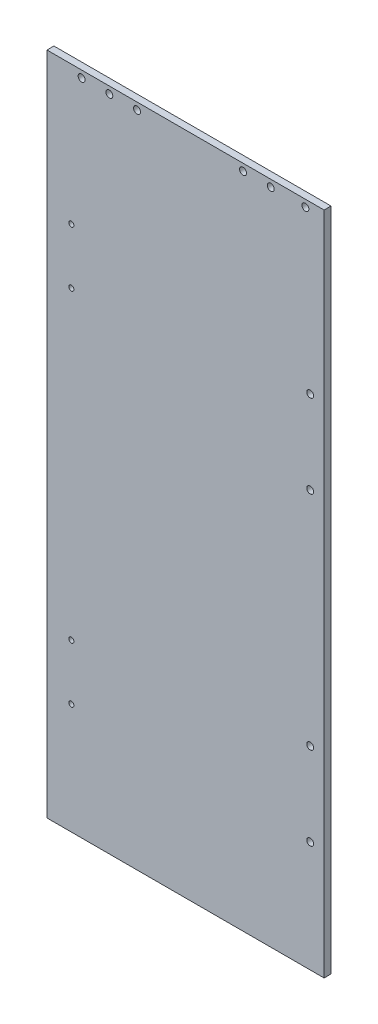
ISO-10303-21;
HEADER;
FILE_DESCRIPTION(('STEP AP214'),'2;1');
FILE_NAME('part.step','',(''),(''),'','','');
FILE_SCHEMA(('AUTOMOTIVE_DESIGN { 1 0 10303 214 1 1 1 1 }'));
ENDSEC;
DATA;
#1=APPLICATION_CONTEXT('core data for automotive mechanical design processes');
#2=APPLICATION_PROTOCOL_DEFINITION('international standard','automotive_design',2000,#1);
#3=PRODUCT_CONTEXT('',#1,'mechanical');
#4=PRODUCT('Part','Part','',(#3));
#5=PRODUCT_RELATED_PRODUCT_CATEGORY('part','',(#4));
#6=PRODUCT_DEFINITION_FORMATION('','',#4);
#7=PRODUCT_DEFINITION_CONTEXT('part definition',#1,'design');
#8=PRODUCT_DEFINITION('design','',#6,#7);
#9=PRODUCT_DEFINITION_SHAPE('','',#8);
#10=(LENGTH_UNIT() NAMED_UNIT(*) SI_UNIT(.MILLI.,.METRE.));
#11=(NAMED_UNIT(*) PLANE_ANGLE_UNIT() SI_UNIT($,.RADIAN.));
#12=(NAMED_UNIT(*) SI_UNIT($,.STERADIAN.) SOLID_ANGLE_UNIT());
#13=UNCERTAINTY_MEASURE_WITH_UNIT(LENGTH_MEASURE(1.E-05),#10,'distance_accuracy_value','');
#14=(GEOMETRIC_REPRESENTATION_CONTEXT(3) GLOBAL_UNCERTAINTY_ASSIGNED_CONTEXT((#13)) GLOBAL_UNIT_ASSIGNED_CONTEXT((#10,
#11,#12)) REPRESENTATION_CONTEXT('',''));
#15=CARTESIAN_POINT('',(0.,0.,0.));
#16=DIRECTION('',(0.,0.,1.));
#17=DIRECTION('',(1.,0.,0.));
#18=AXIS2_PLACEMENT_3D('',#15,#16,#17);
#19=CARTESIAN_POINT('',(-28.5749999999999,0.,6.35));
#20=DIRECTION('',(1.,0.,0.));
#21=DIRECTION('',(0.,1.,0.));
#22=AXIS2_PLACEMENT_3D('',#19,#20,#21);
#23=PLANE('',#22);
#24=DIRECTION('',(0.,-1.,0.));
#25=VECTOR('',#24,1.);
#26=CARTESIAN_POINT('',(-28.5749999999999,0.,0.));
#27=LINE('',#26,#25);
#28=CARTESIAN_POINT('',(-28.5749999999999,0.,0.));
#29=VERTEX_POINT('',#28);
#30=CARTESIAN_POINT('',(-28.5749999999999,-609.6,0.));
#31=VERTEX_POINT('',#30);
#32=EDGE_CURVE('E102',#29,#31,#27,.T.);
#33=ORIENTED_EDGE('',*,*,#32,.T.);
#34=DIRECTION('',(0.,0.,-1.));
#35=VECTOR('',#34,1.);
#36=CARTESIAN_POINT('',(-28.5749999999999,-609.6,6.35));
#37=LINE('',#36,#35);
#38=CARTESIAN_POINT('',(-28.5749999999999,-609.6,6.35));
#39=VERTEX_POINT('',#38);
#40=EDGE_CURVE('E11',#39,#31,#37,.T.);
#41=ORIENTED_EDGE('',*,*,#40,.F.);
#42=DIRECTION('',(0.,-1.,0.));
#43=VECTOR('',#42,1.);
#44=CARTESIAN_POINT('',(-28.5749999999999,0.,6.35));
#45=LINE('',#44,#43);
#46=CARTESIAN_POINT('',(-28.5749999999999,0.,6.35));
#47=VERTEX_POINT('',#46);
#48=EDGE_CURVE('E90',#47,#39,#45,.T.);
#49=ORIENTED_EDGE('',*,*,#48,.F.);
#50=DIRECTION('',(0.,0.,-1.));
#51=VECTOR('',#50,1.);
#52=CARTESIAN_POINT('',(-28.5749999999999,0.,6.35));
#53=LINE('',#52,#51);
#54=EDGE_CURVE('E98',#47,#29,#53,.T.);
#55=ORIENTED_EDGE('',*,*,#54,.T.);
#56=EDGE_LOOP('',(#33,#41,#49,#55));
#57=FACE_BOUND('',#56,.T.);
#58=ADVANCED_FACE('F39',(#57),#23,.F.);
#59=CARTESIAN_POINT('',(-28.5749999999999,-609.6,6.35));
#60=DIRECTION('',(0.,1.,0.));
#61=DIRECTION('',(0.,0.,1.));
#62=AXIS2_PLACEMENT_3D('',#59,#60,#61);
#63=PLANE('',#62);
#64=DIRECTION('',(1.,0.,0.));
#65=VECTOR('',#64,1.);
#66=CARTESIAN_POINT('',(-28.5749999999999,-609.6,0.));
#67=LINE('',#66,#65);
#68=CARTESIAN_POINT('',(225.425,-609.6,0.));
#69=VERTEX_POINT('',#68);
#70=EDGE_CURVE('E94',#31,#69,#67,.T.);
#71=ORIENTED_EDGE('',*,*,#70,.T.);
#72=DIRECTION('',(0.,0.,-1.));
#73=VECTOR('',#72,1.);
#74=CARTESIAN_POINT('',(225.425,-609.6,6.35));
#75=LINE('',#74,#73);
#76=CARTESIAN_POINT('',(225.425,-609.6,6.35));
#77=VERTEX_POINT('',#76);
#78=EDGE_CURVE('E47',#77,#69,#75,.T.);
#79=ORIENTED_EDGE('',*,*,#78,.F.);
#80=DIRECTION('',(1.,0.,0.));
#81=VECTOR('',#80,1.);
#82=CARTESIAN_POINT('',(-28.5749999999999,-609.6,6.35));
#83=LINE('',#82,#81);
#84=EDGE_CURVE('E85',#39,#77,#83,.T.);
#85=ORIENTED_EDGE('',*,*,#84,.F.);
#86=ORIENTED_EDGE('',*,*,#40,.T.);
#87=EDGE_LOOP('',(#71,#79,#85,#86));
#88=FACE_BOUND('',#87,.T.);
#89=ADVANCED_FACE('F93',(#88),#63,.F.);
#90=CARTESIAN_POINT('',(225.425,0.,6.35));
#91=DIRECTION('',(-1.,0.,0.));
#92=DIRECTION('',(0.,-1.,0.));
#93=AXIS2_PLACEMENT_3D('',#90,#91,#92);
#94=PLANE('',#93);
#95=DIRECTION('',(0.,1.,0.));
#96=VECTOR('',#95,1.);
#97=CARTESIAN_POINT('',(225.425,0.,0.));
#98=LINE('',#97,#96);
#99=CARTESIAN_POINT('',(225.425,0.,0.));
#100=VERTEX_POINT('',#99);
#101=EDGE_CURVE('E72',#69,#100,#98,.T.);
#102=ORIENTED_EDGE('',*,*,#101,.T.);
#103=DIRECTION('',(0.,0.,-1.));
#104=VECTOR('',#103,1.);
#105=CARTESIAN_POINT('',(225.425,0.,6.35));
#106=LINE('',#105,#104);
#107=CARTESIAN_POINT('',(225.425,0.,6.35));
#108=VERTEX_POINT('',#107);
#109=EDGE_CURVE('E95',#108,#100,#106,.T.);
#110=ORIENTED_EDGE('',*,*,#109,.F.);
#111=DIRECTION('',(0.,1.,0.));
#112=VECTOR('',#111,1.);
#113=CARTESIAN_POINT('',(225.425,0.,6.35));
#114=LINE('',#113,#112);
#115=EDGE_CURVE('E88',#77,#108,#114,.T.);
#116=ORIENTED_EDGE('',*,*,#115,.F.);
#117=ORIENTED_EDGE('',*,*,#78,.T.);
#118=EDGE_LOOP('',(#102,#110,#116,#117));
#119=FACE_BOUND('',#118,.T.);
#120=ADVANCED_FACE('F96',(#119),#94,.F.);
#121=CARTESIAN_POINT('',(-28.5749999999999,0.,6.35));
#122=DIRECTION('',(0.,-1.,0.));
#123=DIRECTION('',(0.,0.,-1.));
#124=AXIS2_PLACEMENT_3D('',#121,#122,#123);
#125=PLANE('',#124);
#126=DIRECTION('',(-1.,0.,0.));
#127=VECTOR('',#126,1.);
#128=CARTESIAN_POINT('',(-28.5749999999999,0.,0.));
#129=LINE('',#128,#127);
#130=EDGE_CURVE('E78',#100,#29,#129,.T.);
#131=ORIENTED_EDGE('',*,*,#130,.T.);
#132=ORIENTED_EDGE('',*,*,#54,.F.);
#133=DIRECTION('',(-1.,0.,0.));
#134=VECTOR('',#133,1.);
#135=CARTESIAN_POINT('',(-28.5749999999999,0.,6.35));
#136=LINE('',#135,#134);
#137=EDGE_CURVE('E55',#108,#47,#136,.T.);
#138=ORIENTED_EDGE('',*,*,#137,.F.);
#139=ORIENTED_EDGE('',*,*,#109,.T.);
#140=EDGE_LOOP('',(#131,#132,#138,#139));
#141=FACE_BOUND('',#140,.T.);
#142=ADVANCED_FACE('F110',(#141),#125,.F.);
#143=CARTESIAN_POINT('',(0.,0.,6.35));
#144=DIRECTION('',(0.,0.,1.));
#145=DIRECTION('',(1.,0.,0.));
#146=AXIS2_PLACEMENT_3D('',#143,#144,#145);
#147=PLANE('',#146);
#148=CARTESIAN_POINT('',(212.706676403292,-152.4,6.35));
#149=DIRECTION('',(0.,0.,1.));
#150=DIRECTION('',(1.,0.,0.));
#151=AXIS2_PLACEMENT_3D('',#148,#149,#150);
#152=CIRCLE('',#151,3.175);
#153=CARTESIAN_POINT('',(215.881676403292,-152.4,6.35));
#154=VERTEX_POINT('',#153);
#155=EDGE_CURVE('E182',#154,#154,#152,.T.);
#156=ORIENTED_EDGE('',*,*,#155,.F.);
#157=EDGE_LOOP('',(#156));
#158=FACE_BOUND('',#157,.T.);
#159=CARTESIAN_POINT('',(212.706676403292,-228.6,6.35));
#160=DIRECTION('',(0.,0.,1.));
#161=DIRECTION('',(1.,0.,0.));
#162=AXIS2_PLACEMENT_3D('',#159,#160,#161);
#163=CIRCLE('',#162,3.175);
#164=CARTESIAN_POINT('',(215.881676403292,-228.6,6.35));
#165=VERTEX_POINT('',#164);
#166=EDGE_CURVE('E188',#165,#165,#163,.T.);
#167=ORIENTED_EDGE('',*,*,#166,.F.);
#168=EDGE_LOOP('',(#167));
#169=FACE_BOUND('',#168,.T.);
#170=CARTESIAN_POINT('',(212.706676403292,-508.,6.35));
#171=DIRECTION('',(0.,0.,1.));
#172=DIRECTION('',(1.,0.,0.));
#173=AXIS2_PLACEMENT_3D('',#170,#171,#172);
#174=CIRCLE('',#173,3.175);
#175=CARTESIAN_POINT('',(215.881676403292,-508.,6.35));
#176=VERTEX_POINT('',#175);
#177=EDGE_CURVE('E194',#176,#176,#174,.T.);
#178=ORIENTED_EDGE('',*,*,#177,.F.);
#179=EDGE_LOOP('',(#178));
#180=FACE_BOUND('',#179,.T.);
#181=CARTESIAN_POINT('',(212.706676403292,-431.8,6.35));
#182=DIRECTION('',(0.,0.,1.));
#183=DIRECTION('',(1.,0.,0.));
#184=AXIS2_PLACEMENT_3D('',#181,#182,#183);
#185=CIRCLE('',#184,3.175);
#186=CARTESIAN_POINT('',(215.881676403292,-431.8,6.35));
#187=VERTEX_POINT('',#186);
#188=EDGE_CURVE('E176',#187,#187,#185,.T.);
#189=ORIENTED_EDGE('',*,*,#188,.F.);
#190=EDGE_LOOP('',(#189));
#191=FACE_BOUND('',#190,.T.);
#192=CARTESIAN_POINT('',(208.28,-6.35000000001205,6.35));
#193=DIRECTION('',(0.,0.,-1.));
#194=DIRECTION('',(-1.,0.,0.));
#195=AXIS2_PLACEMENT_3D('',#192,#193,#194);
#196=CIRCLE('',#195,3.175);
#197=CARTESIAN_POINT('',(205.105,-6.35000000001205,6.35));
#198=VERTEX_POINT('',#197);
#199=EDGE_CURVE('E120',#198,#198,#196,.T.);
#200=ORIENTED_EDGE('',*,*,#199,.T.);
#201=EDGE_LOOP('',(#200));
#202=FACE_BOUND('',#201,.T.);
#203=CARTESIAN_POINT('',(176.53,-6.35000000001205,6.35));
#204=DIRECTION('',(0.,0.,-1.));
#205=DIRECTION('',(-1.,0.,0.));
#206=AXIS2_PLACEMENT_3D('',#203,#204,#205);
#207=CIRCLE('',#206,3.17499999999994);
#208=CARTESIAN_POINT('',(173.355,-6.35000000001205,6.35));
#209=VERTEX_POINT('',#208);
#210=EDGE_CURVE('E168',#209,#209,#207,.T.);
#211=ORIENTED_EDGE('',*,*,#210,.T.);
#212=EDGE_LOOP('',(#211));
#213=FACE_BOUND('',#212,.T.);
#214=CARTESIAN_POINT('',(151.13,-6.35000000001205,6.35));
#215=DIRECTION('',(0.,0.,-1.));
#216=DIRECTION('',(-1.,0.,0.));
#217=AXIS2_PLACEMENT_3D('',#214,#215,#216);
#218=CIRCLE('',#217,3.17499999999997);
#219=CARTESIAN_POINT('',(147.955,-6.35000000001205,6.35));
#220=VERTEX_POINT('',#219);
#221=EDGE_CURVE('E162',#220,#220,#218,.T.);
#222=ORIENTED_EDGE('',*,*,#221,.T.);
#223=EDGE_LOOP('',(#222));
#224=FACE_BOUND('',#223,.T.);
#225=CARTESIAN_POINT('',(53.9750000000001,-6.35000000001205,6.35));
#226=DIRECTION('',(0.,0.,-1.));
#227=DIRECTION('',(-1.,0.,0.));
#228=AXIS2_PLACEMENT_3D('',#225,#226,#227);
#229=CIRCLE('',#228,3.17499999999997);
#230=CARTESIAN_POINT('',(50.8000000000001,-6.35000000001205,6.35));
#231=VERTEX_POINT('',#230);
#232=EDGE_CURVE('E156',#231,#231,#229,.T.);
#233=ORIENTED_EDGE('',*,*,#232,.T.);
#234=EDGE_LOOP('',(#233));
#235=FACE_BOUND('',#234,.T.);
#236=CARTESIAN_POINT('',(28.5750000000001,-6.35000000001205,6.35));
#237=DIRECTION('',(0.,0.,-1.));
#238=DIRECTION('',(-1.,0.,0.));
#239=AXIS2_PLACEMENT_3D('',#236,#237,#238);
#240=CIRCLE('',#239,3.17499999999997);
#241=CARTESIAN_POINT('',(25.4000000000001,-6.35000000001205,6.35));
#242=VERTEX_POINT('',#241);
#243=EDGE_CURVE('E150',#242,#242,#240,.T.);
#244=ORIENTED_EDGE('',*,*,#243,.T.);
#245=EDGE_LOOP('',(#244));
#246=FACE_BOUND('',#245,.T.);
#247=CARTESIAN_POINT('',(3.17500000000007,-6.35000000001205,6.35));
#248=DIRECTION('',(0.,0.,-1.));
#249=DIRECTION('',(-1.,0.,0.));
#250=AXIS2_PLACEMENT_3D('',#247,#248,#249);
#251=CIRCLE('',#250,3.17499999999997);
#252=CARTESIAN_POINT('',(0.,-6.35000000001205,6.35));
#253=VERTEX_POINT('',#252);
#254=EDGE_CURVE('E143',#253,#253,#251,.T.);
#255=ORIENTED_EDGE('',*,*,#254,.T.);
#256=EDGE_LOOP('',(#255));
#257=FACE_BOUND('',#256,.T.);
#258=CARTESIAN_POINT('',(-6.22299999999993,-127.,6.35));
#259=DIRECTION('',(0.,0.,1.));
#260=DIRECTION('',(1.,0.,0.));
#261=AXIS2_PLACEMENT_3D('',#258,#259,#260);
#262=CIRCLE('',#261,2.38125);
#263=CARTESIAN_POINT('',(-3.84174999999994,-127.,6.35));
#264=VERTEX_POINT('',#263);
#265=EDGE_CURVE('E135',#264,#264,#262,.T.);
#266=ORIENTED_EDGE('',*,*,#265,.F.);
#267=EDGE_LOOP('',(#266));
#268=FACE_BOUND('',#267,.T.);
#269=CARTESIAN_POINT('',(-6.22299999999993,-177.8,6.35));
#270=DIRECTION('',(0.,0.,1.));
#271=DIRECTION('',(1.,0.,0.));
#272=AXIS2_PLACEMENT_3D('',#269,#270,#271);
#273=CIRCLE('',#272,2.38125);
#274=CARTESIAN_POINT('',(-3.84174999999994,-177.8,6.35));
#275=VERTEX_POINT('',#274);
#276=EDGE_CURVE('E129',#275,#275,#273,.T.);
#277=ORIENTED_EDGE('',*,*,#276,.F.);
#278=EDGE_LOOP('',(#277));
#279=FACE_BOUND('',#278,.T.);
#280=CARTESIAN_POINT('',(-6.22299999999993,-457.2,6.35));
#281=DIRECTION('',(0.,0.,1.));
#282=DIRECTION('',(1.,0.,0.));
#283=AXIS2_PLACEMENT_3D('',#280,#281,#282);
#284=CIRCLE('',#283,2.38125000000004);
#285=CARTESIAN_POINT('',(-3.8417499999999,-457.2,6.35));
#286=VERTEX_POINT('',#285);
#287=EDGE_CURVE('E123',#286,#286,#284,.T.);
#288=ORIENTED_EDGE('',*,*,#287,.F.);
#289=EDGE_LOOP('',(#288));
#290=FACE_BOUND('',#289,.T.);
#291=CARTESIAN_POINT('',(-6.22299999999993,-508.,6.35));
#292=DIRECTION('',(0.,0.,1.));
#293=DIRECTION('',(1.,0.,0.));
#294=AXIS2_PLACEMENT_3D('',#291,#292,#293);
#295=CIRCLE('',#294,2.38125000000003);
#296=CARTESIAN_POINT('',(-3.8417499999999,-508.,6.35));
#297=VERTEX_POINT('',#296);
#298=EDGE_CURVE('E116',#297,#297,#295,.T.);
#299=ORIENTED_EDGE('',*,*,#298,.F.);
#300=EDGE_LOOP('',(#299));
#301=FACE_BOUND('',#300,.T.);
#302=ORIENTED_EDGE('',*,*,#48,.T.);
#303=ORIENTED_EDGE('',*,*,#84,.T.);
#304=ORIENTED_EDGE('',*,*,#115,.T.);
#305=ORIENTED_EDGE('',*,*,#137,.T.);
#306=EDGE_LOOP('',(#302,#303,#304,#305));
#307=FACE_BOUND('',#306,.T.);
#308=ADVANCED_FACE('F86',(#158,#169,#180,#191,#202,#213,#224,#235,#246,#257,#268,#279,#290,#301,
#307),#147,.T.);
#309=CARTESIAN_POINT('',(0.,0.,0.));
#310=DIRECTION('',(0.,0.,1.));
#311=DIRECTION('',(1.,0.,0.));
#312=AXIS2_PLACEMENT_3D('',#309,#310,#311);
#313=PLANE('',#312);
#314=CARTESIAN_POINT('',(212.706676403292,-152.4,0.));
#315=DIRECTION('',(0.,0.,1.));
#316=DIRECTION('',(1.,0.,0.));
#317=AXIS2_PLACEMENT_3D('',#314,#315,#316);
#318=CIRCLE('',#317,3.175);
#319=CARTESIAN_POINT('',(215.881676403292,-152.4,0.));
#320=VERTEX_POINT('',#319);
#321=EDGE_CURVE('E185',#320,#320,#318,.T.);
#322=ORIENTED_EDGE('',*,*,#321,.T.);
#323=EDGE_LOOP('',(#322));
#324=FACE_BOUND('',#323,.T.);
#325=CARTESIAN_POINT('',(212.706676403292,-228.6,0.));
#326=DIRECTION('',(0.,0.,1.));
#327=DIRECTION('',(1.,0.,0.));
#328=AXIS2_PLACEMENT_3D('',#325,#326,#327);
#329=CIRCLE('',#328,3.175);
#330=CARTESIAN_POINT('',(215.881676403292,-228.6,0.));
#331=VERTEX_POINT('',#330);
#332=EDGE_CURVE('E191',#331,#331,#329,.T.);
#333=ORIENTED_EDGE('',*,*,#332,.T.);
#334=EDGE_LOOP('',(#333));
#335=FACE_BOUND('',#334,.T.);
#336=CARTESIAN_POINT('',(212.706676403292,-508.,0.));
#337=DIRECTION('',(0.,0.,1.));
#338=DIRECTION('',(1.,0.,0.));
#339=AXIS2_PLACEMENT_3D('',#336,#337,#338);
#340=CIRCLE('',#339,3.175);
#341=CARTESIAN_POINT('',(215.881676403292,-508.,0.));
#342=VERTEX_POINT('',#341);
#343=EDGE_CURVE('E179',#342,#342,#340,.T.);
#344=ORIENTED_EDGE('',*,*,#343,.T.);
#345=EDGE_LOOP('',(#344));
#346=FACE_BOUND('',#345,.T.);
#347=CARTESIAN_POINT('',(212.706676403292,-431.8,0.));
#348=DIRECTION('',(0.,0.,1.));
#349=DIRECTION('',(1.,0.,0.));
#350=AXIS2_PLACEMENT_3D('',#347,#348,#349);
#351=CIRCLE('',#350,3.175);
#352=CARTESIAN_POINT('',(215.881676403292,-431.8,0.));
#353=VERTEX_POINT('',#352);
#354=EDGE_CURVE('E144',#353,#353,#351,.T.);
#355=ORIENTED_EDGE('',*,*,#354,.T.);
#356=EDGE_LOOP('',(#355));
#357=FACE_BOUND('',#356,.T.);
#358=CARTESIAN_POINT('',(208.28,-6.35000000001205,0.));
#359=DIRECTION('',(0.,0.,-1.));
#360=DIRECTION('',(-1.,0.,0.));
#361=AXIS2_PLACEMENT_3D('',#358,#359,#360);
#362=CIRCLE('',#361,3.175);
#363=CARTESIAN_POINT('',(205.105,-6.35000000001205,0.));
#364=VERTEX_POINT('',#363);
#365=EDGE_CURVE('E171',#364,#364,#362,.T.);
#366=ORIENTED_EDGE('',*,*,#365,.F.);
#367=EDGE_LOOP('',(#366));
#368=FACE_BOUND('',#367,.T.);
#369=CARTESIAN_POINT('',(176.53,-6.35000000001205,0.));
#370=DIRECTION('',(0.,0.,-1.));
#371=DIRECTION('',(-1.,0.,0.));
#372=AXIS2_PLACEMENT_3D('',#369,#370,#371);
#373=CIRCLE('',#372,3.17499999999994);
#374=CARTESIAN_POINT('',(173.355,-6.35000000001205,0.));
#375=VERTEX_POINT('',#374);
#376=EDGE_CURVE('E165',#375,#375,#373,.T.);
#377=ORIENTED_EDGE('',*,*,#376,.F.);
#378=EDGE_LOOP('',(#377));
#379=FACE_BOUND('',#378,.T.);
#380=CARTESIAN_POINT('',(151.13,-6.35000000001205,0.));
#381=DIRECTION('',(0.,0.,-1.));
#382=DIRECTION('',(-1.,0.,0.));
#383=AXIS2_PLACEMENT_3D('',#380,#381,#382);
#384=CIRCLE('',#383,3.17499999999997);
#385=CARTESIAN_POINT('',(147.955,-6.35000000001205,0.));
#386=VERTEX_POINT('',#385);
#387=EDGE_CURVE('E159',#386,#386,#384,.T.);
#388=ORIENTED_EDGE('',*,*,#387,.F.);
#389=EDGE_LOOP('',(#388));
#390=FACE_BOUND('',#389,.T.);
#391=CARTESIAN_POINT('',(53.9750000000001,-6.35000000001205,0.));
#392=DIRECTION('',(0.,0.,-1.));
#393=DIRECTION('',(-1.,0.,0.));
#394=AXIS2_PLACEMENT_3D('',#391,#392,#393);
#395=CIRCLE('',#394,3.17499999999997);
#396=CARTESIAN_POINT('',(50.8000000000001,-6.35000000001205,0.));
#397=VERTEX_POINT('',#396);
#398=EDGE_CURVE('E153',#397,#397,#395,.T.);
#399=ORIENTED_EDGE('',*,*,#398,.F.);
#400=EDGE_LOOP('',(#399));
#401=FACE_BOUND('',#400,.T.);
#402=CARTESIAN_POINT('',(28.5750000000001,-6.35000000001205,0.));
#403=DIRECTION('',(0.,0.,-1.));
#404=DIRECTION('',(-1.,0.,0.));
#405=AXIS2_PLACEMENT_3D('',#402,#403,#404);
#406=CIRCLE('',#405,3.17499999999997);
#407=CARTESIAN_POINT('',(25.4000000000001,-6.35000000001205,0.));
#408=VERTEX_POINT('',#407);
#409=EDGE_CURVE('E147',#408,#408,#406,.T.);
#410=ORIENTED_EDGE('',*,*,#409,.F.);
#411=EDGE_LOOP('',(#410));
#412=FACE_BOUND('',#411,.T.);
#413=CARTESIAN_POINT('',(3.17500000000007,-6.35000000001205,0.));
#414=DIRECTION('',(0.,0.,-1.));
#415=DIRECTION('',(-1.,0.,0.));
#416=AXIS2_PLACEMENT_3D('',#413,#414,#415);
#417=CIRCLE('',#416,3.17499999999997);
#418=CARTESIAN_POINT('',(0.,-6.35000000001205,0.));
#419=VERTEX_POINT('',#418);
#420=EDGE_CURVE('E140',#419,#419,#417,.T.);
#421=ORIENTED_EDGE('',*,*,#420,.F.);
#422=EDGE_LOOP('',(#421));
#423=FACE_BOUND('',#422,.T.);
#424=CARTESIAN_POINT('',(-6.22299999999993,-127.,0.));
#425=DIRECTION('',(0.,0.,1.));
#426=DIRECTION('',(1.,0.,0.));
#427=AXIS2_PLACEMENT_3D('',#424,#425,#426);
#428=CIRCLE('',#427,2.38125);
#429=CARTESIAN_POINT('',(-3.84174999999994,-127.,0.));
#430=VERTEX_POINT('',#429);
#431=EDGE_CURVE('E105',#430,#430,#428,.T.);
#432=ORIENTED_EDGE('',*,*,#431,.T.);
#433=EDGE_LOOP('',(#432));
#434=FACE_BOUND('',#433,.T.);
#435=CARTESIAN_POINT('',(-6.22299999999993,-177.8,0.));
#436=DIRECTION('',(0.,0.,1.));
#437=DIRECTION('',(1.,0.,0.));
#438=AXIS2_PLACEMENT_3D('',#435,#436,#437);
#439=CIRCLE('',#438,2.38125);
#440=CARTESIAN_POINT('',(-3.84174999999994,-177.8,0.));
#441=VERTEX_POINT('',#440);
#442=EDGE_CURVE('E132',#441,#441,#439,.T.);
#443=ORIENTED_EDGE('',*,*,#442,.T.);
#444=EDGE_LOOP('',(#443));
#445=FACE_BOUND('',#444,.T.);
#446=CARTESIAN_POINT('',(-6.22299999999993,-457.2,0.));
#447=DIRECTION('',(0.,0.,1.));
#448=DIRECTION('',(1.,0.,0.));
#449=AXIS2_PLACEMENT_3D('',#446,#447,#448);
#450=CIRCLE('',#449,2.38125000000004);
#451=CARTESIAN_POINT('',(-3.8417499999999,-457.2,0.));
#452=VERTEX_POINT('',#451);
#453=EDGE_CURVE('E126',#452,#452,#450,.T.);
#454=ORIENTED_EDGE('',*,*,#453,.T.);
#455=EDGE_LOOP('',(#454));
#456=FACE_BOUND('',#455,.T.);
#457=CARTESIAN_POINT('',(-6.22299999999993,-508.,0.));
#458=DIRECTION('',(0.,0.,1.));
#459=DIRECTION('',(1.,0.,0.));
#460=AXIS2_PLACEMENT_3D('',#457,#458,#459);
#461=CIRCLE('',#460,2.38125000000003);
#462=CARTESIAN_POINT('',(-3.8417499999999,-508.,0.));
#463=VERTEX_POINT('',#462);
#464=EDGE_CURVE('E119',#463,#463,#461,.T.);
#465=ORIENTED_EDGE('',*,*,#464,.T.);
#466=EDGE_LOOP('',(#465));
#467=FACE_BOUND('',#466,.T.);
#468=ORIENTED_EDGE('',*,*,#32,.F.);
#469=ORIENTED_EDGE('',*,*,#130,.F.);
#470=ORIENTED_EDGE('',*,*,#101,.F.);
#471=ORIENTED_EDGE('',*,*,#70,.F.);
#472=EDGE_LOOP('',(#468,#469,#470,#471));
#473=FACE_BOUND('',#472,.T.);
#474=ADVANCED_FACE('F113',(#324,#335,#346,#357,#368,#379,#390,#401,#412,#423,#434,#445,#456,
#467,#473),#313,.F.);
#475=CARTESIAN_POINT('',(-6.22299999999993,-508.,0.));
#476=DIRECTION('',(0.,0.,1.));
#477=DIRECTION('',(1.,0.,0.));
#478=AXIS2_PLACEMENT_3D('',#475,#476,#477);
#479=CYLINDRICAL_SURFACE('',#478,2.38125000000003);
#480=ORIENTED_EDGE('',*,*,#464,.F.);
#481=EDGE_LOOP('',(#480));
#482=FACE_BOUND('',#481,.T.);
#483=ORIENTED_EDGE('',*,*,#298,.T.);
#484=EDGE_LOOP('',(#483));
#485=FACE_BOUND('',#484,.T.);
#486=ADVANCED_FACE('F236',(#482,#485),#479,.F.);
#487=CARTESIAN_POINT('',(-6.22299999999993,-457.2,0.));
#488=DIRECTION('',(0.,0.,1.));
#489=DIRECTION('',(1.,0.,0.));
#490=AXIS2_PLACEMENT_3D('',#487,#488,#489);
#491=CYLINDRICAL_SURFACE('',#490,2.38125000000004);
#492=ORIENTED_EDGE('',*,*,#453,.F.);
#493=EDGE_LOOP('',(#492));
#494=FACE_BOUND('',#493,.T.);
#495=ORIENTED_EDGE('',*,*,#287,.T.);
#496=EDGE_LOOP('',(#495));
#497=FACE_BOUND('',#496,.T.);
#498=ADVANCED_FACE('F238',(#494,#497),#491,.F.);
#499=CARTESIAN_POINT('',(-6.22299999999993,-177.8,0.));
#500=DIRECTION('',(0.,0.,1.));
#501=DIRECTION('',(1.,0.,0.));
#502=AXIS2_PLACEMENT_3D('',#499,#500,#501);
#503=CYLINDRICAL_SURFACE('',#502,2.38125);
#504=ORIENTED_EDGE('',*,*,#442,.F.);
#505=EDGE_LOOP('',(#504));
#506=FACE_BOUND('',#505,.T.);
#507=ORIENTED_EDGE('',*,*,#276,.T.);
#508=EDGE_LOOP('',(#507));
#509=FACE_BOUND('',#508,.T.);
#510=ADVANCED_FACE('F245',(#506,#509),#503,.F.);
#511=CARTESIAN_POINT('',(-6.22299999999993,-127.,0.));
#512=DIRECTION('',(0.,0.,1.));
#513=DIRECTION('',(1.,0.,0.));
#514=AXIS2_PLACEMENT_3D('',#511,#512,#513);
#515=CYLINDRICAL_SURFACE('',#514,2.38125);
#516=ORIENTED_EDGE('',*,*,#431,.F.);
#517=EDGE_LOOP('',(#516));
#518=FACE_BOUND('',#517,.T.);
#519=ORIENTED_EDGE('',*,*,#265,.T.);
#520=EDGE_LOOP('',(#519));
#521=FACE_BOUND('',#520,.T.);
#522=ADVANCED_FACE('F340',(#518,#521),#515,.F.);
#523=CARTESIAN_POINT('',(3.17500000000007,-6.35000000001205,6.35));
#524=DIRECTION('',(0.,0.,-1.));
#525=DIRECTION('',(-1.,0.,0.));
#526=AXIS2_PLACEMENT_3D('',#523,#524,#525);
#527=CYLINDRICAL_SURFACE('',#526,3.17499999999997);
#528=ORIENTED_EDGE('',*,*,#254,.F.);
#529=EDGE_LOOP('',(#528));
#530=FACE_BOUND('',#529,.T.);
#531=ORIENTED_EDGE('',*,*,#420,.T.);
#532=EDGE_LOOP('',(#531));
#533=FACE_BOUND('',#532,.T.);
#534=ADVANCED_FACE('F336',(#530,#533),#527,.F.);
#535=CARTESIAN_POINT('',(28.5750000000001,-6.35000000001205,6.35));
#536=DIRECTION('',(0.,0.,-1.));
#537=DIRECTION('',(-1.,0.,0.));
#538=AXIS2_PLACEMENT_3D('',#535,#536,#537);
#539=CYLINDRICAL_SURFACE('',#538,3.17499999999997);
#540=ORIENTED_EDGE('',*,*,#243,.F.);
#541=EDGE_LOOP('',(#540));
#542=FACE_BOUND('',#541,.T.);
#543=ORIENTED_EDGE('',*,*,#409,.T.);
#544=EDGE_LOOP('',(#543));
#545=FACE_BOUND('',#544,.T.);
#546=ADVANCED_FACE('F332',(#542,#545),#539,.F.);
#547=CARTESIAN_POINT('',(53.9750000000001,-6.35000000001205,6.35));
#548=DIRECTION('',(0.,0.,-1.));
#549=DIRECTION('',(-1.,0.,0.));
#550=AXIS2_PLACEMENT_3D('',#547,#548,#549);
#551=CYLINDRICAL_SURFACE('',#550,3.17499999999997);
#552=ORIENTED_EDGE('',*,*,#232,.F.);
#553=EDGE_LOOP('',(#552));
#554=FACE_BOUND('',#553,.T.);
#555=ORIENTED_EDGE('',*,*,#398,.T.);
#556=EDGE_LOOP('',(#555));
#557=FACE_BOUND('',#556,.T.);
#558=ADVANCED_FACE('F328',(#554,#557),#551,.F.);
#559=CARTESIAN_POINT('',(151.13,-6.35000000001205,6.35));
#560=DIRECTION('',(0.,0.,-1.));
#561=DIRECTION('',(-1.,0.,0.));
#562=AXIS2_PLACEMENT_3D('',#559,#560,#561);
#563=CYLINDRICAL_SURFACE('',#562,3.17499999999997);
#564=ORIENTED_EDGE('',*,*,#221,.F.);
#565=EDGE_LOOP('',(#564));
#566=FACE_BOUND('',#565,.T.);
#567=ORIENTED_EDGE('',*,*,#387,.T.);
#568=EDGE_LOOP('',(#567));
#569=FACE_BOUND('',#568,.T.);
#570=ADVANCED_FACE('F324',(#566,#569),#563,.F.);
#571=CARTESIAN_POINT('',(176.53,-6.35000000001205,6.35));
#572=DIRECTION('',(0.,0.,-1.));
#573=DIRECTION('',(-1.,0.,0.));
#574=AXIS2_PLACEMENT_3D('',#571,#572,#573);
#575=CYLINDRICAL_SURFACE('',#574,3.17499999999994);
#576=ORIENTED_EDGE('',*,*,#210,.F.);
#577=EDGE_LOOP('',(#576));
#578=FACE_BOUND('',#577,.T.);
#579=ORIENTED_EDGE('',*,*,#376,.T.);
#580=EDGE_LOOP('',(#579));
#581=FACE_BOUND('',#580,.T.);
#582=ADVANCED_FACE('F320',(#578,#581),#575,.F.);
#583=CARTESIAN_POINT('',(208.28,-6.35000000001205,6.35));
#584=DIRECTION('',(0.,0.,-1.));
#585=DIRECTION('',(-1.,0.,0.));
#586=AXIS2_PLACEMENT_3D('',#583,#584,#585);
#587=CYLINDRICAL_SURFACE('',#586,3.175);
#588=ORIENTED_EDGE('',*,*,#199,.F.);
#589=EDGE_LOOP('',(#588));
#590=FACE_BOUND('',#589,.T.);
#591=ORIENTED_EDGE('',*,*,#365,.T.);
#592=EDGE_LOOP('',(#591));
#593=FACE_BOUND('',#592,.T.);
#594=ADVANCED_FACE('F284',(#590,#593),#587,.F.);
#595=CARTESIAN_POINT('',(212.706676403292,-431.8,0.));
#596=DIRECTION('',(0.,0.,1.));
#597=DIRECTION('',(1.,0.,0.));
#598=AXIS2_PLACEMENT_3D('',#595,#596,#597);
#599=CYLINDRICAL_SURFACE('',#598,3.175);
#600=ORIENTED_EDGE('',*,*,#354,.F.);
#601=EDGE_LOOP('',(#600));
#602=FACE_BOUND('',#601,.T.);
#603=ORIENTED_EDGE('',*,*,#188,.T.);
#604=EDGE_LOOP('',(#603));
#605=FACE_BOUND('',#604,.T.);
#606=ADVANCED_FACE('F206',(#602,#605),#599,.F.);
#607=CARTESIAN_POINT('',(212.706676403292,-508.,0.));
#608=DIRECTION('',(0.,0.,1.));
#609=DIRECTION('',(1.,0.,0.));
#610=AXIS2_PLACEMENT_3D('',#607,#608,#609);
#611=CYLINDRICAL_SURFACE('',#610,3.175);
#612=ORIENTED_EDGE('',*,*,#343,.F.);
#613=EDGE_LOOP('',(#612));
#614=FACE_BOUND('',#613,.T.);
#615=ORIENTED_EDGE('',*,*,#177,.T.);
#616=EDGE_LOOP('',(#615));
#617=FACE_BOUND('',#616,.T.);
#618=ADVANCED_FACE('F202',(#614,#617),#611,.F.);
#619=CARTESIAN_POINT('',(212.706676403292,-228.6,0.));
#620=DIRECTION('',(0.,0.,1.));
#621=DIRECTION('',(1.,0.,0.));
#622=AXIS2_PLACEMENT_3D('',#619,#620,#621);
#623=CYLINDRICAL_SURFACE('',#622,3.175);
#624=ORIENTED_EDGE('',*,*,#332,.F.);
#625=EDGE_LOOP('',(#624));
#626=FACE_BOUND('',#625,.T.);
#627=ORIENTED_EDGE('',*,*,#166,.T.);
#628=EDGE_LOOP('',(#627));
#629=FACE_BOUND('',#628,.T.);
#630=ADVANCED_FACE('F205',(#626,#629),#623,.F.);
#631=CARTESIAN_POINT('',(212.706676403292,-152.4,0.));
#632=DIRECTION('',(0.,0.,1.));
#633=DIRECTION('',(1.,0.,0.));
#634=AXIS2_PLACEMENT_3D('',#631,#632,#633);
#635=CYLINDRICAL_SURFACE('',#634,3.175);
#636=ORIENTED_EDGE('',*,*,#321,.F.);
#637=EDGE_LOOP('',(#636));
#638=FACE_BOUND('',#637,.T.);
#639=ORIENTED_EDGE('',*,*,#155,.T.);
#640=EDGE_LOOP('',(#639));
#641=FACE_BOUND('',#640,.T.);
#642=ADVANCED_FACE('F302',(#638,#641),#635,.F.);
#643=CLOSED_SHELL('',(#58,#89,#120,#142,#308,#474,#486,#498,#510,#522,#534,#546,#558,#570,#582,
#594,#606,#618,#630,#642));
#644=MANIFOLD_SOLID_BREP('B2',#643);
#645=ADVANCED_BREP_SHAPE_REPRESENTATION('',(#18,#644),#14);
#646=SHAPE_DEFINITION_REPRESENTATION(#9,#645);
ENDSEC;
END-ISO-10303-21;
